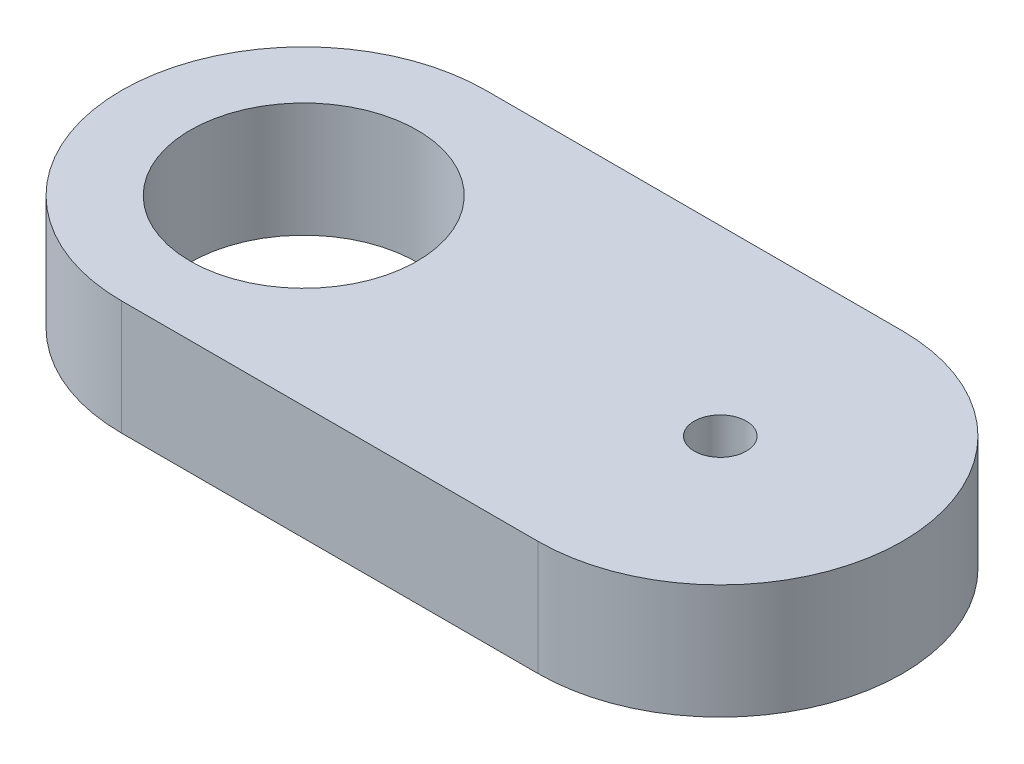
ISO-10303-21;
HEADER;
FILE_DESCRIPTION(('STEP AP214'),'2;1');
FILE_NAME('part.step','',(''),(''),'','','');
FILE_SCHEMA(('AUTOMOTIVE_DESIGN { 1 0 10303 214 1 1 1 1 }'));
ENDSEC;
DATA;
#1=APPLICATION_CONTEXT('core data for automotive mechanical design processes');
#2=APPLICATION_PROTOCOL_DEFINITION('international standard','automotive_design',2000,#1);
#3=PRODUCT_CONTEXT('',#1,'mechanical');
#4=PRODUCT('Part','Part','',(#3));
#5=PRODUCT_RELATED_PRODUCT_CATEGORY('part','',(#4));
#6=PRODUCT_DEFINITION_FORMATION('','',#4);
#7=PRODUCT_DEFINITION_CONTEXT('part definition',#1,'design');
#8=PRODUCT_DEFINITION('design','',#6,#7);
#9=PRODUCT_DEFINITION_SHAPE('','',#8);
#10=(LENGTH_UNIT() NAMED_UNIT(*) SI_UNIT(.MILLI.,.METRE.));
#11=(NAMED_UNIT(*) PLANE_ANGLE_UNIT() SI_UNIT($,.RADIAN.));
#12=(NAMED_UNIT(*) SI_UNIT($,.STERADIAN.) SOLID_ANGLE_UNIT());
#13=UNCERTAINTY_MEASURE_WITH_UNIT(LENGTH_MEASURE(1.E-05),#10,'distance_accuracy_value','');
#14=(GEOMETRIC_REPRESENTATION_CONTEXT(3) GLOBAL_UNCERTAINTY_ASSIGNED_CONTEXT((#13)) GLOBAL_UNIT_ASSIGNED_CONTEXT((#10,
#11,#12)) REPRESENTATION_CONTEXT('',''));
#15=CARTESIAN_POINT('',(0.,0.,0.));
#16=DIRECTION('',(0.,0.,1.));
#17=DIRECTION('',(1.,0.,0.));
#18=AXIS2_PLACEMENT_3D('',#15,#16,#17);
#19=CARTESIAN_POINT('',(0.,11.,0.));
#20=DIRECTION('',(0.,-1.,0.));
#21=DIRECTION('',(0.,0.,-1.));
#22=AXIS2_PLACEMENT_3D('',#19,#20,#21);
#23=CYLINDRICAL_SURFACE('',#22,2.5);
#24=CARTESIAN_POINT('',(0.,7.58182810573239,-2.5));
#25=CARTESIAN_POINT('',(-0.0743038224088702,7.58957578628216,-2.49999617237007));
#26=CARTESIAN_POINT('',(-0.14929303601,7.59179937853304,-2.49665372909764));
#27=CARTESIAN_POINT('',(-0.298242594940311,7.58502823516838,-2.48327718672528));
#28=CARTESIAN_POINT('',(-0.372200720129384,7.57601222303373,-2.4732304131085));
#29=CARTESIAN_POINT('',(-0.516624912160172,7.54726649163929,-2.44713431425357));
#30=CARTESIAN_POINT('',(-0.58710167353314,7.52757214025361,-2.43110485865618));
#31=CARTESIAN_POINT('',(-0.723132245534831,7.47839380754307,-2.39417099624267));
#32=CARTESIAN_POINT('',(-0.788686497721709,7.44891070557655,-2.37326702737164));
#33=CARTESIAN_POINT('',(-0.916899817138108,7.37949352789484,-2.3268379252306));
#34=CARTESIAN_POINT('',(-0.97924867255319,7.33910936952174,-2.30113357510971));
#35=CARTESIAN_POINT('',(-1.09650174672299,7.24978368665412,-2.24763111536754));
#36=CARTESIAN_POINT('',(-1.15139963724818,7.20083496789929,-2.21983125677595));
#37=CARTESIAN_POINT('',(-1.26024158268909,7.08794093777491,-2.16012886714839));
#38=CARTESIAN_POINT('',(-1.31299043297163,7.02285667288976,-2.12819361955863));
#39=CARTESIAN_POINT('',(-1.40723147137508,6.88380546979653,-2.06708858670209));
#40=CARTESIAN_POINT('',(-1.44872609374162,6.80984045746081,-2.03791820429514));
#41=CARTESIAN_POINT('',(-1.5137291865189,6.6665368639642,-1.98997270031522));
#42=CARTESIAN_POINT('',(-1.53904788486245,6.59833044465178,-1.97028231618831));
#43=CARTESIAN_POINT('',(-1.58004566468557,6.45758350372771,-1.93756305029039));
#44=CARTESIAN_POINT('',(-1.59573807494818,6.38504912819975,-1.92452496182648));
#45=CARTESIAN_POINT('',(-1.61676287665817,6.2369560868779,-1.9069026806087));
#46=CARTESIAN_POINT('',(-1.62202844669851,6.16138106154595,-1.90237302440344));
#47=CARTESIAN_POINT('',(-1.62163162734567,6.01027615509354,-1.9027116427277));
#48=CARTESIAN_POINT('',(-1.61596936284233,5.93474627346704,-1.90757980985326));
#49=CARTESIAN_POINT('',(-1.59519290204264,5.79368047916563,-1.92497048559003));
#50=CARTESIAN_POINT('',(-1.58106330927309,5.72789234812308,-1.93669290850177));
#51=CARTESIAN_POINT('',(-1.54486577541628,5.59983490296959,-1.96568679597267));
#52=CARTESIAN_POINT('',(-1.52279437238784,5.53756713715138,-1.98296068013655));
#53=CARTESIAN_POINT('',(-1.46849780326009,5.41074692302036,-2.0235568667292));
#54=CARTESIAN_POINT('',(-1.43541615413964,5.34671106394151,-2.04733828329887));
#55=CARTESIAN_POINT('',(-1.36097040130758,5.22478445667557,-2.09756488053987));
#56=CARTESIAN_POINT('',(-1.31960023857198,5.16689825162437,-2.12401200281155));
#57=CARTESIAN_POINT('',(-1.22065549570499,5.04771661618054,-2.18263345560499));
#58=CARTESIAN_POINT('',(-1.16149778779359,4.98779763627848,-2.21495627974009));
#59=CARTESIAN_POINT('',(-1.03303767852063,4.87871215603585,-2.27770597128901));
#60=CARTESIAN_POINT('',(-0.963731311581397,4.82954987768048,-2.30813209091129));
#61=CARTESIAN_POINT('',(-0.81477782675695,4.74285944345578,-2.36486553469104));
#62=CARTESIAN_POINT('',(-0.734972655276977,4.70554710601121,-2.39109256170184));
#63=CARTESIAN_POINT('',(-0.56807391367883,4.64572495707391,-2.4361291796946));
#64=CARTESIAN_POINT('',(-0.480990934742688,4.62319404336285,-2.45494932942746));
#65=CARTESIAN_POINT('',(-0.3146823318761,4.59635577627556,-2.48134951056397));
#66=CARTESIAN_POINT('',(-0.235968333478774,4.59001036280652,-2.49009812292486));
#67=CARTESIAN_POINT('',(-0.0780662898266164,4.5899033740006,-2.50003035870539));
#68=CARTESIAN_POINT('',(0.00112157082204677,4.59613718056238,-2.50121675771069));
#69=CARTESIAN_POINT('',(0.150947376200109,4.61979400648581,-2.49647396822387));
#70=CARTESIAN_POINT('',(0.221757995901245,4.63626889791944,-2.49111387006652));
#71=CARTESIAN_POINT('',(0.359781546579954,4.67875725108142,-2.47495215461753));
#72=CARTESIAN_POINT('',(0.426994011482898,4.70477194510586,-2.46414983426395));
#73=CARTESIAN_POINT('',(0.560447177123228,4.76725472322038,-2.43737814398909));
#74=CARTESIAN_POINT('',(0.626377027665953,4.80426483209171,-2.42113316145836));
#75=CARTESIAN_POINT('',(0.751605533924934,4.88687337003668,-2.38523387306131));
#76=CARTESIAN_POINT('',(0.81089932844569,4.9324780301991,-2.36557709444937));
#77=CARTESIAN_POINT('',(0.929638979827976,5.0381146420541,-2.3217026279819));
#78=CARTESIAN_POINT('',(0.98799562492105,5.09926683621467,-2.29722888852229));
#79=CARTESIAN_POINT('',(1.09399375591782,5.23042653520723,-2.24868358660375));
#80=CARTESIAN_POINT('',(1.1416335522416,5.30043543364096,-2.22461208811369));
#81=CARTESIAN_POINT('',(1.22010913222516,5.43988932835892,-2.18245035182025));
#82=CARTESIAN_POINT('',(1.25224126024355,5.50848925640089,-2.1639910989675));
#83=CARTESIAN_POINT('',(1.30581840679899,5.65082657537425,-2.13209208663817));
#84=CARTESIAN_POINT('',(1.32727653140416,5.72455753867136,-2.11864617664029));
#85=CARTESIAN_POINT('',(1.35841581058809,5.87607304765801,-2.09882425885236));
#86=CARTESIAN_POINT('',(1.36800348477954,5.95388480083819,-2.09250440338226));
#87=CARTESIAN_POINT('',(1.37430586358671,6.11024581350645,-2.08837342694384));
#88=CARTESIAN_POINT('',(1.37102674846163,6.18879470084628,-2.09055822096342));
#89=CARTESIAN_POINT('',(1.35311510538336,6.33385811158651,-2.10218047844132));
#90=CARTESIAN_POINT('',(1.33996294096184,6.40064333820158,-2.11067084571422));
#91=CARTESIAN_POINT('',(1.30479518751911,6.53098157956271,-2.13258903790036));
#92=CARTESIAN_POINT('',(1.28277508777389,6.59453293082257,-2.14601937525478));
#93=CARTESIAN_POINT('',(1.22859718812062,6.72242588224988,-2.17752252516651));
#94=CARTESIAN_POINT('',(1.19575469966113,6.78640280351855,-2.19588626077126));
#95=CARTESIAN_POINT('',(1.12168261727672,6.9086223809507,-2.23463112246086));
#96=CARTESIAN_POINT('',(1.0804485202968,6.96686193335454,-2.25501332865788));
#97=CARTESIAN_POINT('',(0.981653339176468,7.08767082223386,-2.29996476762659));
#98=CARTESIAN_POINT('',(0.922477139862557,7.14890924672759,-2.32458344826293));
#99=CARTESIAN_POINT('',(0.794302625059033,7.26136090933338,-2.37144330225557));
#100=CARTESIAN_POINT('',(0.725293486183428,7.31256295059208,-2.3936818078152));
#101=CARTESIAN_POINT('',(0.575357214760494,7.40552738590491,-2.43418727275612));
#102=CARTESIAN_POINT('',(0.494028008176068,7.44674754369987,-2.45222462510871));
#103=CARTESIAN_POINT('',(0.3243459057567,7.51445606227824,-2.48034717862614));
#104=CARTESIAN_POINT('',(0.236021719686299,7.54100140130317,-2.49046320079032));
#105=CARTESIAN_POINT('',(0.1218233693785,7.5642966004632,-2.49714847640044));
#106=CARTESIAN_POINT('',(0.0975977117284751,7.56862827520048,-2.49821288014667));
#107=CARTESIAN_POINT('',(0.0489395815730912,7.57611646133862,-2.49963934071423));
#108=CARTESIAN_POINT('',(0.0245070701940587,7.57927274660121,-2.50000126243836));
#109=CARTESIAN_POINT('',(0.,7.58182810573239,-2.5));
#110=B_SPLINE_CURVE_WITH_KNOTS('',3,(#24,#25,#26,#27,#28,#29,#30,#31,#32,#33,#34,#35,#36,#37,
#38,#39,#40,#41,#42,#43,#44,#45,#46,#47,#48,#49,#50,#51,#52,#53,#54,#55,#56,#57,#58,#59,#60,#61,
#62,#63,#64,#65,#66,#67,#68,#69,#70,#71,#72,#73,#74,#75,#76,#77,#78,#79,#80,#81,#82,#83,#84,#85,
#86,#87,#88,#89,#90,#91,#92,#93,#94,#95,#96,#97,#98,#99,#100,#101,#102,#103,#104,#105,#106,#107,
#108,#109),.UNSPECIFIED.,.T.,.F.,(4,2,2,2,2,2,2,2,2,2,2,2,2,2,2,2,2,2,2,2,2,2,2,2,2,2,2,2,2,2,2,
2,2,2,2,2,2,2,2,2,2,2,4),(0.,0.224018869647112,0.448462450657654,0.672167150037789,
0.89585175866275,1.13075764266112,1.36586180411589,1.63367355070173,1.90142732437105,
2.12663865942917,2.35153745357984,2.57787292792912,2.80420581559639,3.00827379717856,
3.21243084270178,3.43930211106229,3.66633983474622,3.93570583821511,4.20517737842843,
4.47930742828438,4.75304526872838,4.99008722852683,5.2270421809725,5.44478626858715,
5.66255849302716,5.893649804306,6.12490930691007,6.38781051386677,6.65075313988097,
6.88372854797486,7.11641718688239,7.35092683919535,7.58532386411188,7.7902296994951,
7.99523989326606,8.21710682882485,8.43909313672021,8.70388848202214,8.96897757932576,
9.24625457306816,9.52244727727433,9.59631952878836,9.67020598557151),.UNSPECIFIED.);
#111=CARTESIAN_POINT('',(0.,7.58182810573239,-2.5));
#112=VERTEX_POINT('',#111);
#113=EDGE_CURVE('E120',#112,#112,#110,.T.);
#114=ORIENTED_EDGE('',*,*,#113,.F.);
#115=EDGE_LOOP('',(#114));
#116=FACE_BOUND('',#115,.T.);
#117=CARTESIAN_POINT('',(0.,11.,0.));
#118=DIRECTION('',(0.,1.,0.));
#119=DIRECTION('',(0.,0.,1.));
#120=AXIS2_PLACEMENT_3D('',#117,#118,#119);
#121=CIRCLE('',#120,2.5);
#122=CARTESIAN_POINT('',(0.,11.,2.5));
#123=VERTEX_POINT('',#122);
#124=EDGE_CURVE('E46',#123,#123,#121,.T.);
#125=ORIENTED_EDGE('',*,*,#124,.T.);
#126=EDGE_LOOP('',(#125));
#127=FACE_BOUND('',#126,.T.);
#128=CARTESIAN_POINT('',(0.,0.,0.));
#129=DIRECTION('',(0.,1.,0.));
#130=DIRECTION('',(0.,0.,1.));
#131=AXIS2_PLACEMENT_3D('',#128,#129,#130);
#132=CIRCLE('',#131,2.5);
#133=CARTESIAN_POINT('',(0.,0.,2.5));
#134=VERTEX_POINT('',#133);
#135=EDGE_CURVE('E126',#134,#134,#132,.T.);
#136=ORIENTED_EDGE('',*,*,#135,.F.);
#137=EDGE_LOOP('',(#136));
#138=FACE_BOUND('',#137,.T.);
#139=ADVANCED_FACE('F37',(#116,#127,#138),#23,.F.);
#140=CARTESIAN_POINT('',(0.,11.,0.));
#141=DIRECTION('',(0.,1.,0.));
#142=DIRECTION('',(0.,0.,1.));
#143=AXIS2_PLACEMENT_3D('',#140,#141,#142);
#144=PLANE('',#143);
#145=CARTESIAN_POINT('',(-40.,11.,0.));
#146=DIRECTION('',(0.,1.,0.));
#147=DIRECTION('',(0.,0.,1.));
#148=AXIS2_PLACEMENT_3D('',#145,#146,#147);
#149=CIRCLE('',#148,10.9);
#150=CARTESIAN_POINT('',(-40.,11.,10.9));
#151=VERTEX_POINT('',#150);
#152=EDGE_CURVE('E264',#151,#151,#149,.T.);
#153=ORIENTED_EDGE('',*,*,#152,.F.);
#154=EDGE_LOOP('',(#153));
#155=FACE_BOUND('',#154,.T.);
#156=ORIENTED_EDGE('',*,*,#124,.F.);
#157=EDGE_LOOP('',(#156));
#158=FACE_BOUND('',#157,.T.);
#159=DIRECTION('',(-1.,0.,0.));
#160=VECTOR('',#159,1.);
#161=CARTESIAN_POINT('',(0.,11.,17.5));
#162=LINE('',#161,#160);
#163=CARTESIAN_POINT('',(0.,11.,17.5));
#164=VERTEX_POINT('',#163);
#165=CARTESIAN_POINT('',(-40.,11.,17.5));
#166=VERTEX_POINT('',#165);
#167=EDGE_CURVE('E115',#164,#166,#162,.T.);
#168=ORIENTED_EDGE('',*,*,#167,.F.);
#169=CARTESIAN_POINT('',(0.,11.,0.));
#170=DIRECTION('',(0.,1.,0.));
#171=DIRECTION('',(0.,0.,1.));
#172=AXIS2_PLACEMENT_3D('',#169,#170,#171);
#173=CIRCLE('',#172,17.5);
#174=CARTESIAN_POINT('',(0.,11.,-17.5));
#175=VERTEX_POINT('',#174);
#176=EDGE_CURVE('E112',#164,#175,#173,.T.);
#177=ORIENTED_EDGE('',*,*,#176,.T.);
#178=DIRECTION('',(1.,0.,0.));
#179=VECTOR('',#178,1.);
#180=CARTESIAN_POINT('',(0.,11.,-17.5));
#181=LINE('',#180,#179);
#182=CARTESIAN_POINT('',(-40.,11.,-17.5));
#183=VERTEX_POINT('',#182);
#184=EDGE_CURVE('E104',#183,#175,#181,.T.);
#185=ORIENTED_EDGE('',*,*,#184,.F.);
#186=CARTESIAN_POINT('',(-40.,11.,0.));
#187=DIRECTION('',(0.,1.,0.));
#188=DIRECTION('',(0.,0.,1.));
#189=AXIS2_PLACEMENT_3D('',#186,#187,#188);
#190=CIRCLE('',#189,17.5);
#191=EDGE_CURVE('E90',#183,#166,#190,.T.);
#192=ORIENTED_EDGE('',*,*,#191,.T.);
#193=EDGE_LOOP('',(#168,#177,#185,#192));
#194=FACE_BOUND('',#193,.T.);
#195=ADVANCED_FACE('F137',(#155,#158,#194),#144,.T.);
#196=CARTESIAN_POINT('',(0.,0.,0.));
#197=DIRECTION('',(0.,1.,0.));
#198=DIRECTION('',(0.,0.,1.));
#199=AXIS2_PLACEMENT_3D('',#196,#197,#198);
#200=PLANE('',#199);
#201=CARTESIAN_POINT('',(-40.,0.,0.));
#202=DIRECTION('',(0.,1.,0.));
#203=DIRECTION('',(0.,0.,1.));
#204=AXIS2_PLACEMENT_3D('',#201,#202,#203);
#205=CIRCLE('',#204,10.9);
#206=CARTESIAN_POINT('',(-40.,0.,10.9));
#207=VERTEX_POINT('',#206);
#208=EDGE_CURVE('E41',#207,#207,#205,.T.);
#209=ORIENTED_EDGE('',*,*,#208,.T.);
#210=EDGE_LOOP('',(#209));
#211=FACE_BOUND('',#210,.T.);
#212=ORIENTED_EDGE('',*,*,#135,.T.);
#213=EDGE_LOOP('',(#212));
#214=FACE_BOUND('',#213,.T.);
#215=CARTESIAN_POINT('',(-40.,0.,0.));
#216=DIRECTION('',(0.,1.,0.));
#217=DIRECTION('',(0.,0.,1.));
#218=AXIS2_PLACEMENT_3D('',#215,#216,#217);
#219=CIRCLE('',#218,17.5);
#220=CARTESIAN_POINT('',(-40.,0.,17.5));
#221=VERTEX_POINT('',#220);
#222=CARTESIAN_POINT('',(-40.,0.,-17.5));
#223=VERTEX_POINT('',#222);
#224=EDGE_CURVE('E79',#221,#223,#219,.F.);
#225=ORIENTED_EDGE('',*,*,#224,.T.);
#226=DIRECTION('',(-1.,0.,0.));
#227=VECTOR('',#226,1.);
#228=CARTESIAN_POINT('',(0.,0.,-17.5));
#229=LINE('',#228,#227);
#230=CARTESIAN_POINT('',(0.,0.,-17.5));
#231=VERTEX_POINT('',#230);
#232=EDGE_CURVE('E82',#231,#223,#229,.T.);
#233=ORIENTED_EDGE('',*,*,#232,.F.);
#234=CARTESIAN_POINT('',(0.,0.,0.));
#235=DIRECTION('',(0.,1.,0.));
#236=DIRECTION('',(0.,0.,1.));
#237=AXIS2_PLACEMENT_3D('',#234,#235,#236);
#238=CIRCLE('',#237,17.5);
#239=CARTESIAN_POINT('',(0.,0.,17.5));
#240=VERTEX_POINT('',#239);
#241=EDGE_CURVE('E89',#231,#240,#238,.F.);
#242=ORIENTED_EDGE('',*,*,#241,.T.);
#243=DIRECTION('',(1.,0.,0.));
#244=VECTOR('',#243,1.);
#245=CARTESIAN_POINT('',(0.,0.,17.5));
#246=LINE('',#245,#244);
#247=EDGE_CURVE('E85',#221,#240,#246,.T.);
#248=ORIENTED_EDGE('',*,*,#247,.F.);
#249=EDGE_LOOP('',(#225,#233,#242,#248));
#250=FACE_BOUND('',#249,.T.);
#251=ADVANCED_FACE('F81',(#211,#214,#250),#200,.F.);
#252=CARTESIAN_POINT('',(0.,6.08995648462951,0.));
#253=DIRECTION('',(-0.0623782861551804,0.,-0.998052578482889));
#254=DIRECTION('',(-0.998052578482889,0.,0.0623782861551804));
#255=AXIS2_PLACEMENT_3D('',#252,#253,#254);
#256=CYLINDRICAL_SURFACE('',#255,1.5);
#257=ORIENTED_EDGE('',*,*,#113,.T.);
#258=EDGE_LOOP('',(#257));
#259=FACE_BOUND('',#258,.T.);
#260=CARTESIAN_POINT('',(-0.622568093385213,6.08995648462951,-9.96108949416343));
#261=DIRECTION('',(-0.0623782861551804,0.,-0.998052578482889));
#262=DIRECTION('',(-0.998052578482889,0.,0.0623782861551804));
#263=AXIS2_PLACEMENT_3D('',#260,#261,#262);
#264=CIRCLE('',#263,1.5);
#265=CARTESIAN_POINT('',(-1.28152696787787E-13,4.72581025286607,-10.));
#266=VERTEX_POINT('',#265);
#267=CARTESIAN_POINT('',(0.,7.45410271639291,-10.));
#268=VERTEX_POINT('',#267);
#269=EDGE_CURVE('E53',#266,#268,#264,.T.);
#270=ORIENTED_EDGE('',*,*,#269,.T.);
#271=CARTESIAN_POINT('',(0.,4.72581025286612,-10.));
#272=CARTESIAN_POINT('',(0.0385478575216246,4.74340312541679,-10.0000009494715));
#273=CARTESIAN_POINT('',(0.0763355430872577,4.76261091920193,-9.99977694242771));
#274=CARTESIAN_POINT('',(0.150158817293017,4.80412719722243,-9.99894052410155));
#275=CARTESIAN_POINT('',(0.186194551157242,4.82643542386083,-9.9983281450717));
#276=CARTESIAN_POINT('',(0.291227968825538,4.89774871639224,-9.99600301913666));
#277=CARTESIAN_POINT('',(0.357271740542428,4.95119726428322,-9.9938019068292));
#278=CARTESIAN_POINT('',(0.47945032724142,5.06837252372374,-9.98868783277391));
#279=CARTESIAN_POINT('',(0.535581846567952,5.13210264029392,-9.98577463503443));
#280=CARTESIAN_POINT('',(0.636346393319139,5.26807830578963,-9.97986044624959));
#281=CARTESIAN_POINT('',(0.680981466481179,5.3403223363656,-9.9768594709298));
#282=CARTESIAN_POINT('',(0.757451559694015,5.49134042305565,-9.9713462236789));
#283=CARTESIAN_POINT('',(0.789282714105013,5.57011644260192,-9.96883409945515));
#284=CARTESIAN_POINT('',(0.839156531597447,5.7319529177882,-9.9647602986097));
#285=CARTESIAN_POINT('',(0.857198449422545,5.81501360473941,-9.96319867335982));
#286=CARTESIAN_POINT('',(0.878815315521569,5.98219892029534,-9.96131527762978));
#287=CARTESIAN_POINT('',(0.882527381529841,6.06630569946891,-9.9609817572396));
#288=CARTESIAN_POINT('',(0.875747333592366,6.23393563332242,-9.96158007731118));
#289=CARTESIAN_POINT('',(0.865256097695264,6.31745882375898,-9.96251183955315));
#290=CARTESIAN_POINT('',(0.830495075922461,6.48108973352656,-9.96546919247895));
#291=CARTESIAN_POINT('',(0.806299939805143,6.56121344994726,-9.9674888541135));
#292=CARTESIAN_POINT('',(0.744916560653594,6.71629601450086,-9.97226358590096));
#293=CARTESIAN_POINT('',(0.707727672442103,6.79125460594913,-9.97501869256923));
#294=CARTESIAN_POINT('',(0.621127274402886,6.93448130358489,-9.98078609023846));
#295=CARTESIAN_POINT('',(0.571627928978742,7.00269617967298,-9.98380012286174));
#296=CARTESIAN_POINT('',(0.461957319394284,7.12993938777143,-9.98947456108659));
#297=CARTESIAN_POINT('',(0.401788444202637,7.18896977069898,-9.9921350456168));
#298=CARTESIAN_POINT('',(0.28592475788376,7.28507284426311,-9.99604237040307));
#299=CARTESIAN_POINT('',(0.231891430092807,7.32416022750435,-9.99746797935454));
#300=CARTESIAN_POINT('',(0.119192725827161,7.39487038886396,-9.9994502815278));
#301=CARTESIAN_POINT('',(0.0605312205599703,7.42649931903897,-10.0000076930191));
#302=CARTESIAN_POINT('',(0.,7.4541027163929,-10.));
#303=B_SPLINE_CURVE_WITH_KNOTS('',3,(#271,#272,#273,#274,#275,#276,#277,#278,#279,#280,#281,
#282,#283,#284,#285,#286,#287,#288,#289,#290,#291,#292,#293,#294,#295,#296,#297,#298,#299,#300,
#301,#302),.UNSPECIFIED.,.F.,.F.,(4,2,2,2,2,2,2,2,2,2,2,2,2,2,2,4),(0.,0.12703856685169,
0.254066585109153,0.507732171146519,0.76148193853613,1.01518652112905,1.26896764245772,
1.52276247873109,1.77412272558014,2.02546743403907,2.27545597273134,2.52545692583977,
2.77729556504615,3.02907788717899,3.22862513861043,3.42800721450082),.UNSPECIFIED.);
#304=EDGE_CURVE('E11',#266,#268,#303,.T.);
#305=ORIENTED_EDGE('',*,*,#304,.F.);
#306=EDGE_LOOP('',(#270,#305));
#307=FACE_BOUND('',#306,.T.);
#308=ADVANCED_FACE('F128',(#259,#307),#256,.F.);
#309=CARTESIAN_POINT('',(0.,-82.7647267862342,0.));
#310=DIRECTION('',(0.,1.,0.));
#311=DIRECTION('',(0.,0.,1.));
#312=AXIS2_PLACEMENT_3D('',#309,#310,#311);
#313=CYLINDRICAL_SURFACE('',#312,10.);
#314=DIRECTION('',(0.,1.,0.));
#315=VECTOR('',#314,1.);
#316=CARTESIAN_POINT('',(0.,-82.7647267862342,-10.));
#317=LINE('',#316,#315);
#318=EDGE_CURVE('E106',#266,#268,#317,.T.);
#319=ORIENTED_EDGE('',*,*,#318,.F.);
#320=ORIENTED_EDGE('',*,*,#304,.T.);
#321=EDGE_LOOP('',(#319,#320));
#322=FACE_BOUND('',#321,.T.);
#323=ADVANCED_FACE('F133',(#322),#313,.F.);
#324=CARTESIAN_POINT('',(-0.622568093385213,-82.7647267862342,-9.96108949416342));
#325=DIRECTION('',(-0.0623782861551804,0.,-0.998052578482889));
#326=DIRECTION('',(-0.998052578482889,0.,0.0623782861551804));
#327=AXIS2_PLACEMENT_3D('',#324,#325,#326);
#328=PLANE('',#327);
#329=ORIENTED_EDGE('',*,*,#318,.T.);
#330=ORIENTED_EDGE('',*,*,#269,.F.);
#331=EDGE_LOOP('',(#329,#330));
#332=FACE_BOUND('',#331,.T.);
#333=ADVANCED_FACE('F177',(#332),#328,.F.);
#334=CARTESIAN_POINT('',(0.,-82.7647267862342,17.5));
#335=DIRECTION('',(0.,0.,-1.));
#336=DIRECTION('',(-1.,0.,0.));
#337=AXIS2_PLACEMENT_3D('',#334,#335,#336);
#338=PLANE('',#337);
#339=DIRECTION('',(0.,1.,0.));
#340=VECTOR('',#339,1.);
#341=CARTESIAN_POINT('',(-40.,-82.7647267862342,17.5));
#342=LINE('',#341,#340);
#343=EDGE_CURVE('E99',#221,#166,#342,.T.);
#344=ORIENTED_EDGE('',*,*,#343,.F.);
#345=ORIENTED_EDGE('',*,*,#247,.T.);
#346=DIRECTION('',(0.,1.,0.));
#347=VECTOR('',#346,1.);
#348=CARTESIAN_POINT('',(0.,-82.7647267862342,17.5));
#349=LINE('',#348,#347);
#350=EDGE_CURVE('E113',#240,#164,#349,.T.);
#351=ORIENTED_EDGE('',*,*,#350,.T.);
#352=ORIENTED_EDGE('',*,*,#167,.T.);
#353=EDGE_LOOP('',(#344,#345,#351,#352));
#354=FACE_BOUND('',#353,.T.);
#355=ADVANCED_FACE('F135',(#354),#338,.F.);
#356=CARTESIAN_POINT('',(-40.,-82.7647267862342,0.));
#357=DIRECTION('',(0.,1.,0.));
#358=DIRECTION('',(0.,0.,1.));
#359=AXIS2_PLACEMENT_3D('',#356,#357,#358);
#360=CYLINDRICAL_SURFACE('',#359,17.5);
#361=ORIENTED_EDGE('',*,*,#224,.F.);
#362=ORIENTED_EDGE('',*,*,#343,.T.);
#363=ORIENTED_EDGE('',*,*,#191,.F.);
#364=DIRECTION('',(0.,1.,0.));
#365=VECTOR('',#364,1.);
#366=CARTESIAN_POINT('',(-40.,-82.7647267862342,-17.5));
#367=LINE('',#366,#365);
#368=EDGE_CURVE('E95',#223,#183,#367,.T.);
#369=ORIENTED_EDGE('',*,*,#368,.F.);
#370=EDGE_LOOP('',(#361,#362,#363,#369));
#371=FACE_BOUND('',#370,.T.);
#372=ADVANCED_FACE('F102',(#371),#360,.T.);
#373=CARTESIAN_POINT('',(0.,-82.7647267862342,-17.5));
#374=DIRECTION('',(0.,0.,1.));
#375=DIRECTION('',(1.,0.,0.));
#376=AXIS2_PLACEMENT_3D('',#373,#374,#375);
#377=PLANE('',#376);
#378=DIRECTION('',(0.,1.,0.));
#379=VECTOR('',#378,1.);
#380=CARTESIAN_POINT('',(0.,-82.7647267862342,-17.5));
#381=LINE('',#380,#379);
#382=EDGE_CURVE('E97',#231,#175,#381,.T.);
#383=ORIENTED_EDGE('',*,*,#382,.F.);
#384=ORIENTED_EDGE('',*,*,#232,.T.);
#385=ORIENTED_EDGE('',*,*,#368,.T.);
#386=ORIENTED_EDGE('',*,*,#184,.T.);
#387=EDGE_LOOP('',(#383,#384,#385,#386));
#388=FACE_BOUND('',#387,.T.);
#389=ADVANCED_FACE('F93',(#388),#377,.F.);
#390=CARTESIAN_POINT('',(0.,-82.7647267862342,0.));
#391=DIRECTION('',(0.,1.,0.));
#392=DIRECTION('',(0.,0.,1.));
#393=AXIS2_PLACEMENT_3D('',#390,#391,#392);
#394=CYLINDRICAL_SURFACE('',#393,17.5);
#395=ORIENTED_EDGE('',*,*,#241,.F.);
#396=ORIENTED_EDGE('',*,*,#382,.T.);
#397=ORIENTED_EDGE('',*,*,#176,.F.);
#398=ORIENTED_EDGE('',*,*,#350,.F.);
#399=EDGE_LOOP('',(#395,#396,#397,#398));
#400=FACE_BOUND('',#399,.T.);
#401=ADVANCED_FACE('F173',(#400),#394,.T.);
#402=CARTESIAN_POINT('',(-40.,-26.7109780839233,0.));
#403=DIRECTION('',(0.,1.,0.));
#404=DIRECTION('',(0.,0.,1.));
#405=AXIS2_PLACEMENT_3D('',#402,#403,#404);
#406=CYLINDRICAL_SURFACE('',#405,10.9);
#407=ORIENTED_EDGE('',*,*,#152,.T.);
#408=EDGE_LOOP('',(#407));
#409=FACE_BOUND('',#408,.T.);
#410=ORIENTED_EDGE('',*,*,#208,.F.);
#411=EDGE_LOOP('',(#410));
#412=FACE_BOUND('',#411,.T.);
#413=ADVANCED_FACE('F193',(#409,#412),#406,.F.);
#414=CLOSED_SHELL('',(#139,#195,#251,#308,#323,#333,#355,#372,#389,#401,#413));
#415=MANIFOLD_SOLID_BREP('B2',#414);
#416=ADVANCED_BREP_SHAPE_REPRESENTATION('',(#18,#415),#14);
#417=SHAPE_DEFINITION_REPRESENTATION(#9,#416);
ENDSEC;
END-ISO-10303-21;
